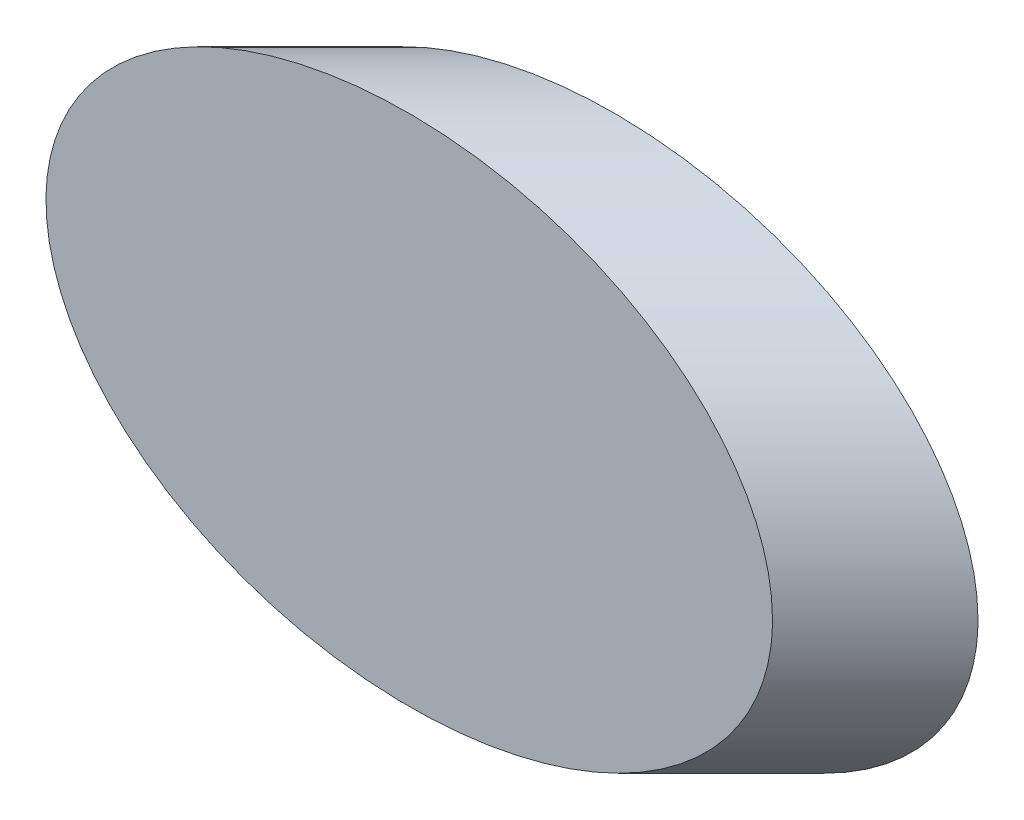
ISO-10303-21;
HEADER;
FILE_DESCRIPTION(('STEP AP214'),'2;1');
FILE_NAME('part.step','',(''),(''),'','','');
FILE_SCHEMA(('AUTOMOTIVE_DESIGN { 1 0 10303 214 1 1 1 1 }'));
ENDSEC;
DATA;
#1=APPLICATION_CONTEXT('core data for automotive mechanical design processes');
#2=APPLICATION_PROTOCOL_DEFINITION('international standard','automotive_design',2000,#1);
#3=PRODUCT_CONTEXT('',#1,'mechanical');
#4=PRODUCT('Part','Part','',(#3));
#5=PRODUCT_RELATED_PRODUCT_CATEGORY('part','',(#4));
#6=PRODUCT_DEFINITION_FORMATION('','',#4);
#7=PRODUCT_DEFINITION_CONTEXT('part definition',#1,'design');
#8=PRODUCT_DEFINITION('design','',#6,#7);
#9=PRODUCT_DEFINITION_SHAPE('','',#8);
#10=(LENGTH_UNIT() NAMED_UNIT(*) SI_UNIT(.MILLI.,.METRE.));
#11=(NAMED_UNIT(*) PLANE_ANGLE_UNIT() SI_UNIT($,.RADIAN.));
#12=(NAMED_UNIT(*) SI_UNIT($,.STERADIAN.) SOLID_ANGLE_UNIT());
#13=UNCERTAINTY_MEASURE_WITH_UNIT(LENGTH_MEASURE(1.E-05),#10,'distance_accuracy_value','');
#14=(GEOMETRIC_REPRESENTATION_CONTEXT(3) GLOBAL_UNCERTAINTY_ASSIGNED_CONTEXT((#13)) GLOBAL_UNIT_ASSIGNED_CONTEXT((#10,
#11,#12)) REPRESENTATION_CONTEXT('',''));
#15=CARTESIAN_POINT('',(0.,0.,0.));
#16=DIRECTION('',(0.,0.,1.));
#17=DIRECTION('',(1.,0.,0.));
#18=AXIS2_PLACEMENT_3D('',#15,#16,#17);
#19=CARTESIAN_POINT('',(0.,0.,0.));
#20=DIRECTION('',(0.,0.,1.));
#21=DIRECTION('',(1.,0.,0.));
#22=AXIS2_PLACEMENT_3D('',#19,#20,#21);
#23=PLANE('',#22);
#24=CARTESIAN_POINT('',(0.,0.,0.));
#25=DIRECTION('',(0.,0.,1.));
#26=DIRECTION('',(1.,0.,0.));
#27=AXIS2_PLACEMENT_3D('',#24,#25,#26);
#28=ELLIPSE('',#27,35.3553390593274,25.);
#29=CARTESIAN_POINT('',(35.3553390593274,0.,0.));
#30=VERTEX_POINT('',#29);
#31=EDGE_CURVE('E36',#30,#30,#28,.F.);
#32=ORIENTED_EDGE('',*,*,#31,.F.);
#33=EDGE_LOOP('',(#32));
#34=FACE_BOUND('',#33,.T.);
#35=ADVANCED_FACE('F33',(#34),#23,.T.);
#36=CARTESIAN_POINT('',(-25.0000000000001,0.,25.));
#37=DIRECTION('',(0.707106781186549,0.,-0.707106781186546));
#38=DIRECTION('',(-0.707106781186546,0.,-0.707106781186549));
#39=AXIS2_PLACEMENT_3D('',#36,#37,#38);
#40=CYLINDRICAL_SURFACE('',#39,25.);
#41=ORIENTED_EDGE('',*,*,#31,.T.);
#42=EDGE_LOOP('',(#41));
#43=FACE_BOUND('',#42,.T.);
#44=CARTESIAN_POINT('',(10.,0.,-10.));
#45=DIRECTION('',(0.,0.,1.));
#46=DIRECTION('',(1.,0.,0.));
#47=AXIS2_PLACEMENT_3D('',#44,#45,#46);
#48=ELLIPSE('',#47,35.3553390593274,25.);
#49=CARTESIAN_POINT('',(45.3553390593275,0.,-10.));
#50=VERTEX_POINT('',#49);
#51=EDGE_CURVE('E10',#50,#50,#48,.F.);
#52=ORIENTED_EDGE('',*,*,#51,.F.);
#53=EDGE_LOOP('',(#52));
#54=FACE_BOUND('',#53,.T.);
#55=ADVANCED_FACE('F45',(#43,#54),#40,.T.);
#56=CARTESIAN_POINT('',(0.,0.,-10.));
#57=DIRECTION('',(0.,0.,1.));
#58=DIRECTION('',(1.,0.,0.));
#59=AXIS2_PLACEMENT_3D('',#56,#57,#58);
#60=PLANE('',#59);
#61=ORIENTED_EDGE('',*,*,#51,.T.);
#62=EDGE_LOOP('',(#61));
#63=FACE_BOUND('',#62,.T.);
#64=ADVANCED_FACE('F52',(#63),#60,.F.);
#65=CLOSED_SHELL('',(#35,#55,#64));
#66=MANIFOLD_SOLID_BREP('B2',#65);
#67=ADVANCED_BREP_SHAPE_REPRESENTATION('',(#18,#66),#14);
#68=SHAPE_DEFINITION_REPRESENTATION(#9,#67);
ENDSEC;
END-ISO-10303-21;
